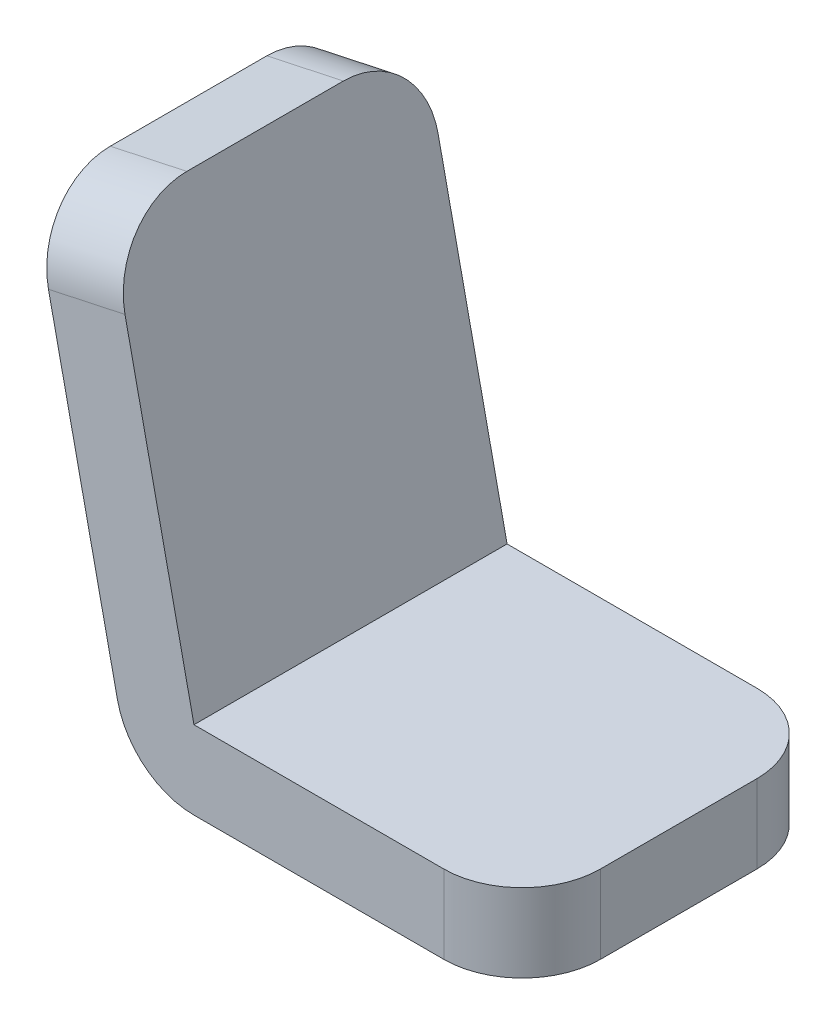
ISO-10303-21;
HEADER;
FILE_DESCRIPTION(('STEP AP214'),'2;1');
FILE_NAME('part.step','',(''),(''),'','','');
FILE_SCHEMA(('AUTOMOTIVE_DESIGN { 1 0 10303 214 1 1 1 1 }'));
ENDSEC;
DATA;
#1=APPLICATION_CONTEXT('core data for automotive mechanical design processes');
#2=APPLICATION_PROTOCOL_DEFINITION('international standard','automotive_design',2000,#1);
#3=PRODUCT_CONTEXT('',#1,'mechanical');
#4=PRODUCT('Part','Part','',(#3));
#5=PRODUCT_RELATED_PRODUCT_CATEGORY('part','',(#4));
#6=PRODUCT_DEFINITION_FORMATION('','',#4);
#7=PRODUCT_DEFINITION_CONTEXT('part definition',#1,'design');
#8=PRODUCT_DEFINITION('design','',#6,#7);
#9=PRODUCT_DEFINITION_SHAPE('','',#8);
#10=(LENGTH_UNIT() NAMED_UNIT(*) SI_UNIT(.MILLI.,.METRE.));
#11=(NAMED_UNIT(*) PLANE_ANGLE_UNIT() SI_UNIT($,.RADIAN.));
#12=(NAMED_UNIT(*) SI_UNIT($,.STERADIAN.) SOLID_ANGLE_UNIT());
#13=UNCERTAINTY_MEASURE_WITH_UNIT(LENGTH_MEASURE(1.E-05),#10,'distance_accuracy_value','');
#14=(GEOMETRIC_REPRESENTATION_CONTEXT(3) GLOBAL_UNCERTAINTY_ASSIGNED_CONTEXT((#13)) GLOBAL_UNIT_ASSIGNED_CONTEXT((#10,
#11,#12)) REPRESENTATION_CONTEXT('',''));
#15=CARTESIAN_POINT('',(0.,0.,0.));
#16=DIRECTION('',(0.,0.,1.));
#17=DIRECTION('',(1.,0.,0.));
#18=AXIS2_PLACEMENT_3D('',#15,#16,#17);
#19=CARTESIAN_POINT('',(-10.50814162749,48.8833198497873,10.));
#20=DIRECTION('',(-0.977666396995747,-0.210162832549799,0.));
#21=DIRECTION('',(0.210162832549799,-0.977666396995747,0.));
#22=AXIS2_PLACEMENT_3D('',#19,#20,#21);
#23=CYLINDRICAL_SURFACE('',#22,10.);
#24=DIRECTION('',(-0.977666396995747,-0.210162832549799,0.));
#25=VECTOR('',#24,1.);
#26=CARTESIAN_POINT('',(-12.609769952988,58.6599838197448,10.));
#27=LINE('',#26,#25);
#28=CARTESIAN_POINT('',(-2.83310598303051,60.7616121452428,10.));
#29=VERTEX_POINT('',#28);
#30=CARTESIAN_POINT('',(-12.609769952988,58.6599838197448,10.));
#31=VERTEX_POINT('',#30);
#32=EDGE_CURVE('E238',#29,#31,#27,.T.);
#33=ORIENTED_EDGE('',*,*,#32,.F.);
#34=CARTESIAN_POINT('',(-0.731477657532512,50.9849481752853,10.));
#35=DIRECTION('',(-0.977666396995747,-0.2101628325498,0.));
#36=DIRECTION('',(0.2101628325498,-0.977666396995747,0.));
#37=AXIS2_PLACEMENT_3D('',#34,#35,#36);
#38=CIRCLE('',#37,10.);
#39=CARTESIAN_POINT('',(-0.731477657532514,50.9849481752853,0.));
#40=VERTEX_POINT('',#39);
#41=EDGE_CURVE('E53',#40,#29,#38,.F.);
#42=ORIENTED_EDGE('',*,*,#41,.F.);
#43=DIRECTION('',(-0.977666396995747,-0.210162832549799,0.));
#44=VECTOR('',#43,1.);
#45=CARTESIAN_POINT('',(-0.731477657532491,50.9849481752853,0.));
#46=LINE('',#45,#44);
#47=CARTESIAN_POINT('',(-10.50814162749,48.8833198497873,0.));
#48=VERTEX_POINT('',#47);
#49=EDGE_CURVE('E242',#48,#40,#46,.F.);
#50=ORIENTED_EDGE('',*,*,#49,.F.);
#51=CARTESIAN_POINT('',(-10.50814162749,48.8833198497873,10.));
#52=DIRECTION('',(-0.977666396995747,-0.2101628325498,0.));
#53=DIRECTION('',(0.2101628325498,-0.977666396995747,0.));
#54=AXIS2_PLACEMENT_3D('',#51,#52,#53);
#55=CIRCLE('',#54,10.);
#56=EDGE_CURVE('E11',#31,#48,#55,.T.);
#57=ORIENTED_EDGE('',*,*,#56,.F.);
#58=EDGE_LOOP('',(#33,#42,#50,#57));
#59=FACE_BOUND('',#58,.T.);
#60=ADVANCED_FACE('F45',(#59),#23,.T.);
#61=CARTESIAN_POINT('',(40.,10.,10.));
#62=DIRECTION('',(0.,1.,0.));
#63=DIRECTION('',(0.,0.,1.));
#64=AXIS2_PLACEMENT_3D('',#61,#62,#63);
#65=CYLINDRICAL_SURFACE('',#64,10.);
#66=DIRECTION('',(0.,1.,0.));
#67=VECTOR('',#66,1.);
#68=CARTESIAN_POINT('',(50.,10.,10.));
#69=LINE('',#68,#67);
#70=CARTESIAN_POINT('',(50.,0.,10.));
#71=VERTEX_POINT('',#70);
#72=CARTESIAN_POINT('',(50.,10.,10.));
#73=VERTEX_POINT('',#72);
#74=EDGE_CURVE('E224',#71,#73,#69,.T.);
#75=ORIENTED_EDGE('',*,*,#74,.F.);
#76=CARTESIAN_POINT('',(40.,0.,10.));
#77=DIRECTION('',(0.,-1.,0.));
#78=DIRECTION('',(0.,0.,-1.));
#79=AXIS2_PLACEMENT_3D('',#76,#77,#78);
#80=CIRCLE('',#79,10.);
#81=CARTESIAN_POINT('',(40.,0.,0.));
#82=VERTEX_POINT('',#81);
#83=EDGE_CURVE('E232',#82,#71,#80,.T.);
#84=ORIENTED_EDGE('',*,*,#83,.F.);
#85=DIRECTION('',(0.,1.,0.));
#86=VECTOR('',#85,1.);
#87=CARTESIAN_POINT('',(40.,10.,0.));
#88=LINE('',#87,#86);
#89=CARTESIAN_POINT('',(40.,10.,0.));
#90=VERTEX_POINT('',#89);
#91=EDGE_CURVE('E228',#90,#82,#88,.F.);
#92=ORIENTED_EDGE('',*,*,#91,.F.);
#93=CARTESIAN_POINT('',(40.,10.,10.));
#94=DIRECTION('',(0.,-1.,0.));
#95=DIRECTION('',(0.,0.,-1.));
#96=AXIS2_PLACEMENT_3D('',#93,#94,#95);
#97=CIRCLE('',#96,10.);
#98=EDGE_CURVE('E235',#73,#90,#97,.F.);
#99=ORIENTED_EDGE('',*,*,#98,.F.);
#100=EDGE_LOOP('',(#75,#84,#92,#99));
#101=FACE_BOUND('',#100,.T.);
#102=ADVANCED_FACE('F278',(#101),#65,.T.);
#103=CARTESIAN_POINT('',(40.,10.,30.));
#104=DIRECTION('',(0.,-1.,0.));
#105=DIRECTION('',(0.,0.,-1.));
#106=AXIS2_PLACEMENT_3D('',#103,#104,#105);
#107=CYLINDRICAL_SURFACE('',#106,10.);
#108=DIRECTION('',(0.,1.,0.));
#109=VECTOR('',#108,1.);
#110=CARTESIAN_POINT('',(40.,10.,40.));
#111=LINE('',#110,#109);
#112=CARTESIAN_POINT('',(40.,0.,40.));
#113=VERTEX_POINT('',#112);
#114=CARTESIAN_POINT('',(40.,10.,40.));
#115=VERTEX_POINT('',#114);
#116=EDGE_CURVE('E210',#113,#115,#111,.T.);
#117=ORIENTED_EDGE('',*,*,#116,.F.);
#118=CARTESIAN_POINT('',(40.,0.,30.));
#119=DIRECTION('',(0.,-1.,0.));
#120=DIRECTION('',(0.,0.,-1.));
#121=AXIS2_PLACEMENT_3D('',#118,#119,#120);
#122=CIRCLE('',#121,10.);
#123=CARTESIAN_POINT('',(50.,0.,30.));
#124=VERTEX_POINT('',#123);
#125=EDGE_CURVE('E218',#124,#113,#122,.T.);
#126=ORIENTED_EDGE('',*,*,#125,.F.);
#127=DIRECTION('',(0.,1.,0.));
#128=VECTOR('',#127,1.);
#129=CARTESIAN_POINT('',(50.,10.,30.));
#130=LINE('',#129,#128);
#131=CARTESIAN_POINT('',(50.,10.,30.));
#132=VERTEX_POINT('',#131);
#133=EDGE_CURVE('E214',#132,#124,#130,.F.);
#134=ORIENTED_EDGE('',*,*,#133,.F.);
#135=CARTESIAN_POINT('',(40.,10.,30.));
#136=DIRECTION('',(0.,-1.,0.));
#137=DIRECTION('',(0.,0.,-1.));
#138=AXIS2_PLACEMENT_3D('',#135,#136,#137);
#139=CIRCLE('',#138,10.);
#140=EDGE_CURVE('E221',#115,#132,#139,.F.);
#141=ORIENTED_EDGE('',*,*,#140,.F.);
#142=EDGE_LOOP('',(#117,#126,#134,#141));
#143=FACE_BOUND('',#142,.T.);
#144=ADVANCED_FACE('F272',(#143),#107,.T.);
#145=CARTESIAN_POINT('',(-0.731477657532491,50.9849481752853,30.));
#146=DIRECTION('',(0.977666396995747,0.210162832549799,0.));
#147=DIRECTION('',(-0.210162832549799,0.977666396995747,0.));
#148=AXIS2_PLACEMENT_3D('',#145,#146,#147);
#149=CYLINDRICAL_SURFACE('',#148,10.);
#150=DIRECTION('',(-0.977666396995747,-0.210162832549799,0.));
#151=VECTOR('',#150,1.);
#152=CARTESIAN_POINT('',(-0.731477657532491,50.9849481752853,40.));
#153=LINE('',#152,#151);
#154=CARTESIAN_POINT('',(-0.731477657532514,50.9849481752853,40.));
#155=VERTEX_POINT('',#154);
#156=CARTESIAN_POINT('',(-10.50814162749,48.8833198497873,40.));
#157=VERTEX_POINT('',#156);
#158=EDGE_CURVE('E146',#155,#157,#153,.T.);
#159=ORIENTED_EDGE('',*,*,#158,.F.);
#160=CARTESIAN_POINT('',(-0.731477657532513,50.9849481752853,30.));
#161=DIRECTION('',(-0.977666396995747,-0.2101628325498,0.));
#162=DIRECTION('',(0.2101628325498,-0.977666396995747,0.));
#163=AXIS2_PLACEMENT_3D('',#160,#161,#162);
#164=CIRCLE('',#163,10.);
#165=CARTESIAN_POINT('',(-2.83310598303051,60.7616121452428,30.));
#166=VERTEX_POINT('',#165);
#167=EDGE_CURVE('E204',#166,#155,#164,.F.);
#168=ORIENTED_EDGE('',*,*,#167,.F.);
#169=DIRECTION('',(-0.977666396995747,-0.210162832549799,0.));
#170=VECTOR('',#169,1.);
#171=CARTESIAN_POINT('',(-2.83310598303048,60.7616121452428,30.));
#172=LINE('',#171,#170);
#173=CARTESIAN_POINT('',(-12.609769952988,58.6599838197448,30.));
#174=VERTEX_POINT('',#173);
#175=EDGE_CURVE('E200',#174,#166,#172,.F.);
#176=ORIENTED_EDGE('',*,*,#175,.F.);
#177=CARTESIAN_POINT('',(-10.50814162749,48.8833198497873,30.));
#178=DIRECTION('',(-0.977666396995747,-0.2101628325498,0.));
#179=DIRECTION('',(0.2101628325498,-0.977666396995747,0.));
#180=AXIS2_PLACEMENT_3D('',#177,#178,#179);
#181=CIRCLE('',#180,10.);
#182=EDGE_CURVE('E207',#157,#174,#181,.T.);
#183=ORIENTED_EDGE('',*,*,#182,.F.);
#184=EDGE_LOOP('',(#159,#168,#176,#183));
#185=FACE_BOUND('',#184,.T.);
#186=ADVANCED_FACE('F254',(#185),#149,.T.);
#187=CARTESIAN_POINT('',(8.0788003952808,10.0000000000001,40.));
#188=DIRECTION('',(-0.977666396995747,-0.2101628325498,0.));
#189=DIRECTION('',(0.2101628325498,-0.977666396995747,0.));
#190=AXIS2_PLACEMENT_3D('',#187,#188,#189);
#191=PLANE('',#190);
#192=DIRECTION('',(-0.2101628325498,0.977666396995747,0.));
#193=VECTOR('',#192,1.);
#194=CARTESIAN_POINT('',(8.0788003952808,10.0000000000001,0.));
#195=LINE('',#194,#193);
#196=CARTESIAN_POINT('',(8.07880039528081,10.,0.));
#197=VERTEX_POINT('',#196);
#198=EDGE_CURVE('E164',#197,#40,#195,.T.);
#199=ORIENTED_EDGE('',*,*,#198,.T.);
#200=ORIENTED_EDGE('',*,*,#41,.T.);
#201=DIRECTION('',(0.,0.,-1.));
#202=VECTOR('',#201,1.);
#203=CARTESIAN_POINT('',(-2.83310598303051,60.7616121452428,40.));
#204=LINE('',#203,#202);
#205=EDGE_CURVE('E194',#166,#29,#204,.T.);
#206=ORIENTED_EDGE('',*,*,#205,.F.);
#207=ORIENTED_EDGE('',*,*,#167,.T.);
#208=DIRECTION('',(-0.2101628325498,0.977666396995747,0.));
#209=VECTOR('',#208,1.);
#210=CARTESIAN_POINT('',(8.0788003952808,10.0000000000001,40.));
#211=LINE('',#210,#209);
#212=CARTESIAN_POINT('',(8.07880039528081,10.,40.));
#213=VERTEX_POINT('',#212);
#214=EDGE_CURVE('E148',#213,#155,#211,.T.);
#215=ORIENTED_EDGE('',*,*,#214,.F.);
#216=DIRECTION('',(0.,0.,-1.));
#217=VECTOR('',#216,1.);
#218=CARTESIAN_POINT('',(8.07880039528081,10.,40.));
#219=LINE('',#218,#217);
#220=EDGE_CURVE('E163',#213,#197,#219,.T.);
#221=ORIENTED_EDGE('',*,*,#220,.T.);
#222=EDGE_LOOP('',(#199,#200,#206,#207,#215,#221));
#223=FACE_BOUND('',#222,.T.);
#224=ADVANCED_FACE('F247',(#223),#191,.F.);
#225=CARTESIAN_POINT('',(-12.609769952988,58.6599838197448,40.));
#226=DIRECTION('',(-0.210162832549799,0.977666396995747,0.));
#227=DIRECTION('',(-0.977666396995747,-0.210162832549799,0.));
#228=AXIS2_PLACEMENT_3D('',#225,#226,#227);
#229=PLANE('',#228);
#230=ORIENTED_EDGE('',*,*,#205,.T.);
#231=ORIENTED_EDGE('',*,*,#32,.T.);
#232=DIRECTION('',(0.,0.,-1.));
#233=VECTOR('',#232,1.);
#234=CARTESIAN_POINT('',(-12.609769952988,58.6599838197448,40.));
#235=LINE('',#234,#233);
#236=EDGE_CURVE('E135',#174,#31,#235,.T.);
#237=ORIENTED_EDGE('',*,*,#236,.F.);
#238=ORIENTED_EDGE('',*,*,#175,.T.);
#239=EDGE_LOOP('',(#230,#231,#237,#238));
#240=FACE_BOUND('',#239,.T.);
#241=ADVANCED_FACE('F251',(#240),#229,.T.);
#242=CARTESIAN_POINT('',(-1.69786357467667,7.89837167450206,40.));
#243=DIRECTION('',(-0.977666396995747,-0.2101628325498,0.));
#244=DIRECTION('',(0.2101628325498,-0.977666396995747,0.));
#245=AXIS2_PLACEMENT_3D('',#242,#243,#244);
#246=PLANE('',#245);
#247=ORIENTED_EDGE('',*,*,#236,.T.);
#248=ORIENTED_EDGE('',*,*,#56,.T.);
#249=DIRECTION('',(-0.2101628325498,0.977666396995747,0.));
#250=VECTOR('',#249,1.);
#251=CARTESIAN_POINT('',(-1.69786357467667,7.89837167450206,0.));
#252=LINE('',#251,#250);
#253=CARTESIAN_POINT('',(-1.69786357467667,7.89837167450206,0.));
#254=VERTEX_POINT('',#253);
#255=EDGE_CURVE('E129',#254,#48,#252,.T.);
#256=ORIENTED_EDGE('',*,*,#255,.F.);
#257=DIRECTION('',(0.,0.,-1.));
#258=VECTOR('',#257,1.);
#259=CARTESIAN_POINT('',(-1.69786357467667,7.89837167450206,40.));
#260=LINE('',#259,#258);
#261=CARTESIAN_POINT('',(-1.69786357467667,7.89837167450206,40.));
#262=VERTEX_POINT('',#261);
#263=EDGE_CURVE('E124',#262,#254,#260,.T.);
#264=ORIENTED_EDGE('',*,*,#263,.F.);
#265=DIRECTION('',(-0.2101628325498,0.977666396995747,0.));
#266=VECTOR('',#265,1.);
#267=CARTESIAN_POINT('',(-1.69786357467667,7.89837167450206,40.));
#268=LINE('',#267,#266);
#269=EDGE_CURVE('E127',#262,#157,#268,.T.);
#270=ORIENTED_EDGE('',*,*,#269,.T.);
#271=ORIENTED_EDGE('',*,*,#182,.T.);
#272=EDGE_LOOP('',(#247,#248,#256,#264,#270,#271));
#273=FACE_BOUND('',#272,.T.);
#274=ADVANCED_FACE('F126',(#273),#246,.T.);
#275=CARTESIAN_POINT('',(8.07880039528081,10.,40.));
#276=DIRECTION('',(0.,0.,-1.));
#277=DIRECTION('',(-1.,0.,0.));
#278=AXIS2_PLACEMENT_3D('',#275,#276,#277);
#279=CYLINDRICAL_SURFACE('',#278,10.);
#280=CARTESIAN_POINT('',(8.07880039528081,10.,0.));
#281=DIRECTION('',(0.,0.,-1.));
#282=DIRECTION('',(-1.,0.,0.));
#283=AXIS2_PLACEMENT_3D('',#280,#281,#282);
#284=CIRCLE('',#283,10.);
#285=CARTESIAN_POINT('',(8.07880039528087,0.,0.));
#286=VERTEX_POINT('',#285);
#287=EDGE_CURVE('E170',#286,#254,#284,.T.);
#288=ORIENTED_EDGE('',*,*,#287,.F.);
#289=DIRECTION('',(0.,0.,-1.));
#290=VECTOR('',#289,1.);
#291=CARTESIAN_POINT('',(8.07880039528087,0.,40.));
#292=LINE('',#291,#290);
#293=CARTESIAN_POINT('',(8.07880039528087,0.,40.));
#294=VERTEX_POINT('',#293);
#295=EDGE_CURVE('E136',#294,#286,#292,.T.);
#296=ORIENTED_EDGE('',*,*,#295,.F.);
#297=CARTESIAN_POINT('',(8.07880039528081,10.,40.));
#298=DIRECTION('',(0.,0.,-1.));
#299=DIRECTION('',(-1.,0.,0.));
#300=AXIS2_PLACEMENT_3D('',#297,#298,#299);
#301=CIRCLE('',#300,10.);
#302=EDGE_CURVE('E143',#294,#262,#301,.T.);
#303=ORIENTED_EDGE('',*,*,#302,.T.);
#304=ORIENTED_EDGE('',*,*,#263,.T.);
#305=EDGE_LOOP('',(#288,#296,#303,#304));
#306=FACE_BOUND('',#305,.T.);
#307=ADVANCED_FACE('F151',(#306),#279,.T.);
#308=CARTESIAN_POINT('',(50.,0.,40.));
#309=DIRECTION('',(0.,-1.,0.));
#310=DIRECTION('',(0.,0.,-1.));
#311=AXIS2_PLACEMENT_3D('',#308,#309,#310);
#312=PLANE('',#311);
#313=DIRECTION('',(-1.,0.,0.));
#314=VECTOR('',#313,1.);
#315=CARTESIAN_POINT('',(50.,0.,0.));
#316=LINE('',#315,#314);
#317=EDGE_CURVE('E173',#82,#286,#316,.T.);
#318=ORIENTED_EDGE('',*,*,#317,.F.);
#319=ORIENTED_EDGE('',*,*,#83,.T.);
#320=DIRECTION('',(0.,0.,-1.));
#321=VECTOR('',#320,1.);
#322=CARTESIAN_POINT('',(50.,0.,40.));
#323=LINE('',#322,#321);
#324=EDGE_CURVE('E186',#124,#71,#323,.T.);
#325=ORIENTED_EDGE('',*,*,#324,.F.);
#326=ORIENTED_EDGE('',*,*,#125,.T.);
#327=DIRECTION('',(-1.,0.,0.));
#328=VECTOR('',#327,1.);
#329=CARTESIAN_POINT('',(50.,0.,40.));
#330=LINE('',#329,#328);
#331=EDGE_CURVE('E154',#113,#294,#330,.T.);
#332=ORIENTED_EDGE('',*,*,#331,.T.);
#333=ORIENTED_EDGE('',*,*,#295,.T.);
#334=EDGE_LOOP('',(#318,#319,#325,#326,#332,#333));
#335=FACE_BOUND('',#334,.T.);
#336=ADVANCED_FACE('F268',(#335),#312,.T.);
#337=CARTESIAN_POINT('',(50.,10.,40.));
#338=DIRECTION('',(1.,0.,0.));
#339=DIRECTION('',(0.,0.,-1.));
#340=AXIS2_PLACEMENT_3D('',#337,#338,#339);
#341=PLANE('',#340);
#342=ORIENTED_EDGE('',*,*,#324,.T.);
#343=ORIENTED_EDGE('',*,*,#74,.T.);
#344=DIRECTION('',(0.,0.,-1.));
#345=VECTOR('',#344,1.);
#346=CARTESIAN_POINT('',(50.,10.,40.));
#347=LINE('',#346,#345);
#348=EDGE_CURVE('E182',#132,#73,#347,.T.);
#349=ORIENTED_EDGE('',*,*,#348,.F.);
#350=ORIENTED_EDGE('',*,*,#133,.T.);
#351=EDGE_LOOP('',(#342,#343,#349,#350));
#352=FACE_BOUND('',#351,.T.);
#353=ADVANCED_FACE('F275',(#352),#341,.T.);
#354=CARTESIAN_POINT('',(50.,10.,40.));
#355=DIRECTION('',(0.,-1.,0.));
#356=DIRECTION('',(0.,0.,-1.));
#357=AXIS2_PLACEMENT_3D('',#354,#355,#356);
#358=PLANE('',#357);
#359=ORIENTED_EDGE('',*,*,#348,.T.);
#360=ORIENTED_EDGE('',*,*,#98,.T.);
#361=DIRECTION('',(1.,0.,0.));
#362=VECTOR('',#361,1.);
#363=CARTESIAN_POINT('',(50.,10.,0.));
#364=LINE('',#363,#362);
#365=EDGE_CURVE('E176',#90,#197,#364,.F.);
#366=ORIENTED_EDGE('',*,*,#365,.T.);
#367=ORIENTED_EDGE('',*,*,#220,.F.);
#368=DIRECTION('',(1.,0.,0.));
#369=VECTOR('',#368,1.);
#370=CARTESIAN_POINT('',(50.,10.,40.));
#371=LINE('',#370,#369);
#372=EDGE_CURVE('E157',#115,#213,#371,.F.);
#373=ORIENTED_EDGE('',*,*,#372,.F.);
#374=ORIENTED_EDGE('',*,*,#140,.T.);
#375=EDGE_LOOP('',(#359,#360,#366,#367,#373,#374));
#376=FACE_BOUND('',#375,.T.);
#377=ADVANCED_FACE('F261',(#376),#358,.F.);
#378=CARTESIAN_POINT('',(8.07880039528081,10.,40.));
#379=DIRECTION('',(0.,0.,-1.));
#380=DIRECTION('',(-1.,0.,0.));
#381=AXIS2_PLACEMENT_3D('',#378,#379,#380);
#382=PLANE('',#381);
#383=ORIENTED_EDGE('',*,*,#331,.F.);
#384=ORIENTED_EDGE('',*,*,#116,.T.);
#385=ORIENTED_EDGE('',*,*,#372,.T.);
#386=ORIENTED_EDGE('',*,*,#214,.T.);
#387=ORIENTED_EDGE('',*,*,#158,.T.);
#388=ORIENTED_EDGE('',*,*,#269,.F.);
#389=ORIENTED_EDGE('',*,*,#302,.F.);
#390=EDGE_LOOP('',(#383,#384,#385,#386,#387,#388,#389));
#391=FACE_BOUND('',#390,.T.);
#392=ADVANCED_FACE('F142',(#391),#382,.F.);
#393=CARTESIAN_POINT('',(8.07880039528081,10.,0.));
#394=DIRECTION('',(0.,0.,-1.));
#395=DIRECTION('',(-1.,0.,0.));
#396=AXIS2_PLACEMENT_3D('',#393,#394,#395);
#397=PLANE('',#396);
#398=ORIENTED_EDGE('',*,*,#255,.T.);
#399=ORIENTED_EDGE('',*,*,#49,.T.);
#400=ORIENTED_EDGE('',*,*,#198,.F.);
#401=ORIENTED_EDGE('',*,*,#365,.F.);
#402=ORIENTED_EDGE('',*,*,#91,.T.);
#403=ORIENTED_EDGE('',*,*,#317,.T.);
#404=ORIENTED_EDGE('',*,*,#287,.T.);
#405=EDGE_LOOP('',(#398,#399,#400,#401,#402,#403,#404));
#406=FACE_BOUND('',#405,.T.);
#407=ADVANCED_FACE('F265',(#406),#397,.T.);
#408=CLOSED_SHELL('',(#60,#102,#144,#186,#224,#241,#274,#307,#336,#353,#377,#392,#407));
#409=MANIFOLD_SOLID_BREP('B2',#408);
#410=ADVANCED_BREP_SHAPE_REPRESENTATION('',(#18,#409),#14);
#411=SHAPE_DEFINITION_REPRESENTATION(#9,#410);
ENDSEC;
END-ISO-10303-21;
